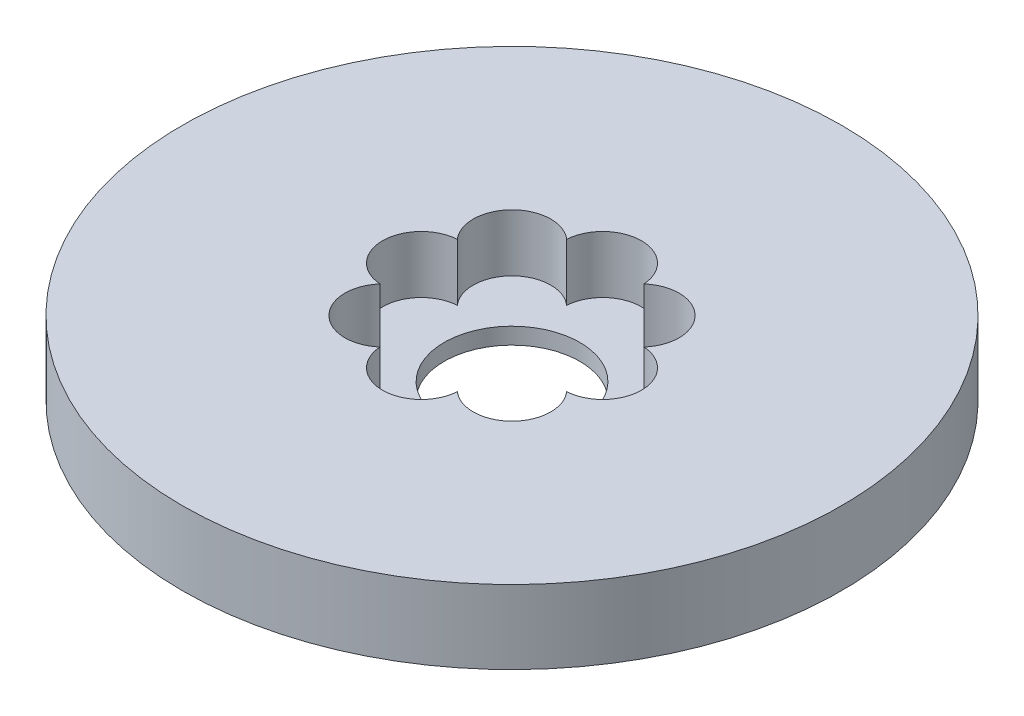
ISO-10303-21;
HEADER;
FILE_DESCRIPTION(('STEP AP214'),'2;1');
FILE_NAME('part.step','',(''),(''),'','','');
FILE_SCHEMA(('AUTOMOTIVE_DESIGN { 1 0 10303 214 1 1 1 1 }'));
ENDSEC;
DATA;
#1=APPLICATION_CONTEXT('core data for automotive mechanical design processes');
#2=APPLICATION_PROTOCOL_DEFINITION('international standard','automotive_design',2000,#1);
#3=PRODUCT_CONTEXT('',#1,'mechanical');
#4=PRODUCT('Part','Part','',(#3));
#5=PRODUCT_RELATED_PRODUCT_CATEGORY('part','',(#4));
#6=PRODUCT_DEFINITION_FORMATION('','',#4);
#7=PRODUCT_DEFINITION_CONTEXT('part definition',#1,'design');
#8=PRODUCT_DEFINITION('design','',#6,#7);
#9=PRODUCT_DEFINITION_SHAPE('','',#8);
#10=(LENGTH_UNIT() NAMED_UNIT(*) SI_UNIT(.MILLI.,.METRE.));
#11=(NAMED_UNIT(*) PLANE_ANGLE_UNIT() SI_UNIT($,.RADIAN.));
#12=(NAMED_UNIT(*) SI_UNIT($,.STERADIAN.) SOLID_ANGLE_UNIT());
#13=UNCERTAINTY_MEASURE_WITH_UNIT(LENGTH_MEASURE(1.E-05),#10,'distance_accuracy_value','');
#14=(GEOMETRIC_REPRESENTATION_CONTEXT(3) GLOBAL_UNCERTAINTY_ASSIGNED_CONTEXT((#13)) GLOBAL_UNIT_ASSIGNED_CONTEXT((#10,
#11,#12)) REPRESENTATION_CONTEXT('',''));
#15=CARTESIAN_POINT('',(0.,0.,0.));
#16=DIRECTION('',(0.,0.,1.));
#17=DIRECTION('',(1.,0.,0.));
#18=AXIS2_PLACEMENT_3D('',#15,#16,#17);
#19=CARTESIAN_POINT('',(0.,19.,0.));
#20=DIRECTION('',(0.,-1.,0.));
#21=DIRECTION('',(0.,0.,-1.));
#22=AXIS2_PLACEMENT_3D('',#19,#20,#21);
#23=CYLINDRICAL_SURFACE('',#22,17.5);
#24=CARTESIAN_POINT('',(0.,0.,0.));
#25=DIRECTION('',(0.,1.,0.));
#26=DIRECTION('',(0.,0.,1.));
#27=AXIS2_PLACEMENT_3D('',#24,#25,#26);
#28=CIRCLE('',#27,17.5);
#29=CARTESIAN_POINT('',(0.,0.,17.5));
#30=VERTEX_POINT('',#29);
#31=EDGE_CURVE('E166',#30,#30,#28,.T.);
#32=ORIENTED_EDGE('',*,*,#31,.F.);
#33=EDGE_LOOP('',(#32));
#34=FACE_BOUND('',#33,.T.);
#35=CARTESIAN_POINT('',(0.,4.2381909272558,0.));
#36=DIRECTION('',(0.,1.,0.));
#37=DIRECTION('',(0.,0.,1.));
#38=AXIS2_PLACEMENT_3D('',#35,#36,#37);
#39=CIRCLE('',#38,17.5);
#40=CARTESIAN_POINT('',(0.,4.2381909272558,17.5));
#41=VERTEX_POINT('',#40);
#42=EDGE_CURVE('E11',#41,#41,#39,.T.);
#43=ORIENTED_EDGE('',*,*,#42,.T.);
#44=EDGE_LOOP('',(#43));
#45=FACE_BOUND('',#44,.T.);
#46=ADVANCED_FACE('F39',(#34,#45),#23,.F.);
#47=CARTESIAN_POINT('',(0.,19.,0.));
#48=DIRECTION('',(0.,-1.,0.));
#49=DIRECTION('',(0.,0.,-1.));
#50=AXIS2_PLACEMENT_3D('',#47,#48,#49);
#51=CYLINDRICAL_SURFACE('',#50,85.);
#52=CARTESIAN_POINT('',(0.,19.,0.));
#53=DIRECTION('',(0.,1.,0.));
#54=DIRECTION('',(0.,0.,1.));
#55=AXIS2_PLACEMENT_3D('',#52,#53,#54);
#56=CIRCLE('',#55,85.);
#57=CARTESIAN_POINT('',(0.,19.,85.));
#58=VERTEX_POINT('',#57);
#59=EDGE_CURVE('E50',#58,#58,#56,.T.);
#60=ORIENTED_EDGE('',*,*,#59,.F.);
#61=EDGE_LOOP('',(#60));
#62=FACE_BOUND('',#61,.T.);
#63=CARTESIAN_POINT('',(0.,0.,0.));
#64=DIRECTION('',(0.,1.,0.));
#65=DIRECTION('',(0.,0.,1.));
#66=AXIS2_PLACEMENT_3D('',#63,#64,#65);
#67=CIRCLE('',#66,85.);
#68=CARTESIAN_POINT('',(0.,0.,85.));
#69=VERTEX_POINT('',#68);
#70=EDGE_CURVE('E173',#69,#69,#67,.T.);
#71=ORIENTED_EDGE('',*,*,#70,.T.);
#72=EDGE_LOOP('',(#71));
#73=FACE_BOUND('',#72,.T.);
#74=ADVANCED_FACE('F41',(#62,#73),#51,.T.);
#75=CARTESIAN_POINT('',(0.,19.,0.));
#76=DIRECTION('',(0.,1.,0.));
#77=DIRECTION('',(0.,0.,1.));
#78=AXIS2_PLACEMENT_3D('',#75,#76,#77);
#79=PLANE('',#78);
#80=CARTESIAN_POINT('',(-16.5430914188715,19.,16.5430914188716));
#81=DIRECTION('',(0.,1.,0.));
#82=DIRECTION('',(0.707106781186549,0.,0.707106781186546));
#83=AXIS2_PLACEMENT_3D('',#80,#81,#82);
#84=CIRCLE('',#83,10.);
#85=CARTESIAN_POINT('',(-24.0847207788115,19.,9.97621799255285));
#86=VERTEX_POINT('',#85);
#87=CARTESIAN_POINT('',(-9.97621799255276,19.,24.0847207788115));
#88=VERTEX_POINT('',#87);
#89=EDGE_CURVE('E159',#86,#88,#84,.T.);
#90=ORIENTED_EDGE('',*,*,#89,.F.);
#91=CARTESIAN_POINT('',(-23.3954642481461,19.,0.));
#92=DIRECTION('',(0.,1.,0.));
#93=DIRECTION('',(0.,0.,1.));
#94=AXIS2_PLACEMENT_3D('',#91,#92,#93);
#95=CIRCLE('',#94,10.);
#96=CARTESIAN_POINT('',(-24.0847207788119,19.,-9.97621799255282));
#97=VERTEX_POINT('',#96);
#98=EDGE_CURVE('E167',#97,#86,#95,.T.);
#99=ORIENTED_EDGE('',*,*,#98,.F.);
#100=CARTESIAN_POINT('',(-16.5430914188718,19.,-16.5430914188714));
#101=DIRECTION('',(0.,1.,0.));
#102=DIRECTION('',(-0.707106781186539,0.,0.707106781186556));
#103=AXIS2_PLACEMENT_3D('',#100,#101,#102);
#104=CIRCLE('',#103,10.);
#105=CARTESIAN_POINT('',(-9.9762179925531,19.,-24.0847207788114));
#106=VERTEX_POINT('',#105);
#107=EDGE_CURVE('E53',#106,#97,#104,.T.);
#108=ORIENTED_EDGE('',*,*,#107,.F.);
#109=CARTESIAN_POINT('',(-2.45054480507922E-13,19.,-23.3954642481461));
#110=DIRECTION('',(0.,1.,0.));
#111=DIRECTION('',(-1.,0.,0.));
#112=AXIS2_PLACEMENT_3D('',#109,#110,#111);
#113=CIRCLE('',#112,10.);
#114=CARTESIAN_POINT('',(9.97621799255259,19.,-24.0847207788116));
#115=VERTEX_POINT('',#114);
#116=EDGE_CURVE('E117',#115,#106,#113,.T.);
#117=ORIENTED_EDGE('',*,*,#116,.F.);
#118=CARTESIAN_POINT('',(16.5430914188714,19.,-16.5430914188717));
#119=DIRECTION('',(0.,1.,0.));
#120=DIRECTION('',(-0.707106781186554,0.,-0.707106781186541));
#121=AXIS2_PLACEMENT_3D('',#118,#119,#120);
#122=CIRCLE('',#121,10.);
#123=CARTESIAN_POINT('',(24.0847207788113,19.,-9.97621799255286));
#124=VERTEX_POINT('',#123);
#125=EDGE_CURVE('E120',#124,#115,#122,.T.);
#126=ORIENTED_EDGE('',*,*,#125,.F.);
#127=CARTESIAN_POINT('',(23.3954642481461,19.,0.));
#128=DIRECTION('',(0.,1.,0.));
#129=DIRECTION('',(0.,0.,-1.));
#130=AXIS2_PLACEMENT_3D('',#127,#128,#129);
#131=CIRCLE('',#130,10.);
#132=CARTESIAN_POINT('',(24.0847207788117,19.,9.97621799255283));
#133=VERTEX_POINT('',#132);
#134=EDGE_CURVE('E136',#133,#124,#131,.T.);
#135=ORIENTED_EDGE('',*,*,#134,.F.);
#136=CARTESIAN_POINT('',(16.5430914188717,19.,16.5430914188715));
#137=DIRECTION('',(0.,1.,0.));
#138=DIRECTION('',(0.707106781186544,0.,-0.707106781186551));
#139=AXIS2_PLACEMENT_3D('',#136,#137,#138);
#140=CIRCLE('',#139,10.);
#141=CARTESIAN_POINT('',(9.97621799255293,19.,24.0847207788115));
#142=VERTEX_POINT('',#141);
#143=EDGE_CURVE('E138',#142,#133,#140,.T.);
#144=ORIENTED_EDGE('',*,*,#143,.F.);
#145=CARTESIAN_POINT('',(0.,19.,23.3954642481461));
#146=DIRECTION('',(0.,1.,0.));
#147=DIRECTION('',(1.,0.,0.));
#148=AXIS2_PLACEMENT_3D('',#145,#146,#147);
#149=CIRCLE('',#148,10.);
#150=EDGE_CURVE('E146',#88,#142,#149,.T.);
#151=ORIENTED_EDGE('',*,*,#150,.F.);
#152=EDGE_LOOP('',(#90,#99,#108,#117,#126,#135,#144,#151));
#153=FACE_BOUND('',#152,.T.);
#154=ORIENTED_EDGE('',*,*,#59,.T.);
#155=EDGE_LOOP('',(#154));
#156=FACE_BOUND('',#155,.T.);
#157=ADVANCED_FACE('F181',(#153,#156),#79,.T.);
#158=CARTESIAN_POINT('',(0.,0.,0.));
#159=DIRECTION('',(0.,1.,0.));
#160=DIRECTION('',(0.,0.,1.));
#161=AXIS2_PLACEMENT_3D('',#158,#159,#160);
#162=PLANE('',#161);
#163=ORIENTED_EDGE('',*,*,#31,.T.);
#164=EDGE_LOOP('',(#163));
#165=FACE_BOUND('',#164,.T.);
#166=ORIENTED_EDGE('',*,*,#70,.F.);
#167=EDGE_LOOP('',(#166));
#168=FACE_BOUND('',#167,.T.);
#169=ADVANCED_FACE('F179',(#165,#168),#162,.F.);
#170=CARTESIAN_POINT('',(-23.3954642481461,4.2381909272558,0.));
#171=DIRECTION('',(0.,1.,0.));
#172=DIRECTION('',(0.,0.,1.));
#173=AXIS2_PLACEMENT_3D('',#170,#171,#172);
#174=CYLINDRICAL_SURFACE('',#173,10.);
#175=ORIENTED_EDGE('',*,*,#98,.T.);
#176=DIRECTION('',(0.,1.,0.));
#177=VECTOR('',#176,1.);
#178=CARTESIAN_POINT('',(-24.0847207788115,11.6190954636279,9.97621799255285));
#179=LINE('',#178,#177);
#180=CARTESIAN_POINT('',(-24.0847207788115,4.2381909272558,9.97621799255285));
#181=VERTEX_POINT('',#180);
#182=EDGE_CURVE('E65',#86,#181,#179,.F.);
#183=ORIENTED_EDGE('',*,*,#182,.T.);
#184=CARTESIAN_POINT('',(-23.3954642481461,4.2381909272558,0.));
#185=DIRECTION('',(0.,1.,0.));
#186=DIRECTION('',(0.,0.,1.));
#187=AXIS2_PLACEMENT_3D('',#184,#185,#186);
#188=CIRCLE('',#187,10.);
#189=CARTESIAN_POINT('',(-24.0847207788119,4.2381909272558,-9.97621799255282));
#190=VERTEX_POINT('',#189);
#191=EDGE_CURVE('E170',#190,#181,#188,.T.);
#192=ORIENTED_EDGE('',*,*,#191,.F.);
#193=DIRECTION('',(0.,1.,0.));
#194=VECTOR('',#193,1.);
#195=CARTESIAN_POINT('',(-24.0847207788119,11.6190954636279,-9.97621799255282));
#196=LINE('',#195,#194);
#197=EDGE_CURVE('E124',#190,#97,#196,.T.);
#198=ORIENTED_EDGE('',*,*,#197,.T.);
#199=EDGE_LOOP('',(#175,#183,#192,#198));
#200=FACE_BOUND('',#199,.T.);
#201=ADVANCED_FACE('F185',(#200),#174,.F.);
#202=CARTESIAN_POINT('',(-23.3954642481461,4.2381909272558,0.));
#203=DIRECTION('',(0.,1.,0.));
#204=DIRECTION('',(0.,0.,1.));
#205=AXIS2_PLACEMENT_3D('',#202,#203,#204);
#206=PLANE('',#205);
#207=ORIENTED_EDGE('',*,*,#191,.T.);
#208=CARTESIAN_POINT('',(-16.5430914188715,4.2381909272558,16.5430914188716));
#209=DIRECTION('',(0.,1.,0.));
#210=DIRECTION('',(0.707106781186549,0.,0.707106781186546));
#211=AXIS2_PLACEMENT_3D('',#208,#209,#210);
#212=CIRCLE('',#211,10.);
#213=CARTESIAN_POINT('',(-9.97621799255276,4.2381909272558,24.0847207788115));
#214=VERTEX_POINT('',#213);
#215=EDGE_CURVE('E161',#181,#214,#212,.T.);
#216=ORIENTED_EDGE('',*,*,#215,.T.);
#217=CARTESIAN_POINT('',(0.,4.2381909272558,23.3954642481461));
#218=DIRECTION('',(0.,1.,0.));
#219=DIRECTION('',(1.,0.,0.));
#220=AXIS2_PLACEMENT_3D('',#217,#218,#219);
#221=CIRCLE('',#220,10.);
#222=CARTESIAN_POINT('',(9.97621799255293,4.2381909272558,24.0847207788115));
#223=VERTEX_POINT('',#222);
#224=EDGE_CURVE('E149',#214,#223,#221,.T.);
#225=ORIENTED_EDGE('',*,*,#224,.T.);
#226=CARTESIAN_POINT('',(16.5430914188717,4.2381909272558,16.5430914188715));
#227=DIRECTION('',(0.,1.,0.));
#228=DIRECTION('',(0.707106781186544,0.,-0.707106781186551));
#229=AXIS2_PLACEMENT_3D('',#226,#227,#228);
#230=CIRCLE('',#229,10.);
#231=CARTESIAN_POINT('',(24.0847207788117,4.2381909272558,9.97621799255283));
#232=VERTEX_POINT('',#231);
#233=EDGE_CURVE('E143',#223,#232,#230,.T.);
#234=ORIENTED_EDGE('',*,*,#233,.T.);
#235=CARTESIAN_POINT('',(23.3954642481461,4.2381909272558,0.));
#236=DIRECTION('',(0.,1.,0.));
#237=DIRECTION('',(0.,0.,-1.));
#238=AXIS2_PLACEMENT_3D('',#235,#236,#237);
#239=CIRCLE('',#238,10.);
#240=CARTESIAN_POINT('',(24.0847207788113,4.2381909272558,-9.97621799255286));
#241=VERTEX_POINT('',#240);
#242=EDGE_CURVE('E140',#232,#241,#239,.T.);
#243=ORIENTED_EDGE('',*,*,#242,.T.);
#244=CARTESIAN_POINT('',(16.5430914188714,4.2381909272558,-16.5430914188717));
#245=DIRECTION('',(0.,1.,0.));
#246=DIRECTION('',(-0.707106781186554,0.,-0.707106781186541));
#247=AXIS2_PLACEMENT_3D('',#244,#245,#246);
#248=CIRCLE('',#247,10.);
#249=CARTESIAN_POINT('',(9.97621799255259,4.2381909272558,-24.0847207788116));
#250=VERTEX_POINT('',#249);
#251=EDGE_CURVE('E111',#241,#250,#248,.T.);
#252=ORIENTED_EDGE('',*,*,#251,.T.);
#253=CARTESIAN_POINT('',(-2.45054480507922E-13,4.2381909272558,-23.3954642481461));
#254=DIRECTION('',(0.,1.,0.));
#255=DIRECTION('',(-1.,0.,0.));
#256=AXIS2_PLACEMENT_3D('',#253,#254,#255);
#257=CIRCLE('',#256,10.);
#258=CARTESIAN_POINT('',(-9.9762179925531,4.2381909272558,-24.0847207788114));
#259=VERTEX_POINT('',#258);
#260=EDGE_CURVE('E104',#250,#259,#257,.T.);
#261=ORIENTED_EDGE('',*,*,#260,.T.);
#262=CARTESIAN_POINT('',(-16.5430914188718,4.2381909272558,-16.5430914188714));
#263=DIRECTION('',(0.,1.,0.));
#264=DIRECTION('',(-0.707106781186539,0.,0.707106781186556));
#265=AXIS2_PLACEMENT_3D('',#262,#263,#264);
#266=CIRCLE('',#265,10.);
#267=EDGE_CURVE('E112',#259,#190,#266,.T.);
#268=ORIENTED_EDGE('',*,*,#267,.T.);
#269=EDGE_LOOP('',(#207,#216,#225,#234,#243,#252,#261,#268));
#270=FACE_BOUND('',#269,.T.);
#271=ORIENTED_EDGE('',*,*,#42,.F.);
#272=EDGE_LOOP('',(#271));
#273=FACE_BOUND('',#272,.T.);
#274=ADVANCED_FACE('F107',(#270,#273),#206,.T.);
#275=CARTESIAN_POINT('',(-16.5430914188715,4.2381909272558,16.5430914188716));
#276=DIRECTION('',(0.,1.,0.));
#277=DIRECTION('',(0.,0.,1.));
#278=AXIS2_PLACEMENT_3D('',#275,#276,#277);
#279=CYLINDRICAL_SURFACE('',#278,10.);
#280=ORIENTED_EDGE('',*,*,#89,.T.);
#281=DIRECTION('',(0.,1.,0.));
#282=VECTOR('',#281,1.);
#283=CARTESIAN_POINT('',(-9.97621799255276,11.6190954636279,24.0847207788115));
#284=LINE('',#283,#282);
#285=EDGE_CURVE('E160',#88,#214,#284,.F.);
#286=ORIENTED_EDGE('',*,*,#285,.T.);
#287=ORIENTED_EDGE('',*,*,#215,.F.);
#288=ORIENTED_EDGE('',*,*,#182,.F.);
#289=EDGE_LOOP('',(#280,#286,#287,#288));
#290=FACE_BOUND('',#289,.T.);
#291=ADVANCED_FACE('F202',(#290),#279,.F.);
#292=CARTESIAN_POINT('',(-16.5430914188718,4.2381909272558,-16.5430914188714));
#293=DIRECTION('',(0.,1.,0.));
#294=DIRECTION('',(0.,0.,1.));
#295=AXIS2_PLACEMENT_3D('',#292,#293,#294);
#296=CYLINDRICAL_SURFACE('',#295,10.);
#297=ORIENTED_EDGE('',*,*,#267,.F.);
#298=DIRECTION('',(0.,1.,0.));
#299=VECTOR('',#298,1.);
#300=CARTESIAN_POINT('',(-9.9762179925531,11.6190954636279,-24.0847207788114));
#301=LINE('',#300,#299);
#302=EDGE_CURVE('E119',#106,#259,#301,.F.);
#303=ORIENTED_EDGE('',*,*,#302,.F.);
#304=ORIENTED_EDGE('',*,*,#107,.T.);
#305=ORIENTED_EDGE('',*,*,#197,.F.);
#306=EDGE_LOOP('',(#297,#303,#304,#305));
#307=FACE_BOUND('',#306,.T.);
#308=ADVANCED_FACE('F123',(#307),#296,.F.);
#309=CARTESIAN_POINT('',(0.,4.2381909272558,23.3954642481461));
#310=DIRECTION('',(0.,1.,0.));
#311=DIRECTION('',(0.,0.,1.));
#312=AXIS2_PLACEMENT_3D('',#309,#310,#311);
#313=CYLINDRICAL_SURFACE('',#312,10.);
#314=ORIENTED_EDGE('',*,*,#150,.T.);
#315=DIRECTION('',(0.,1.,0.));
#316=VECTOR('',#315,1.);
#317=CARTESIAN_POINT('',(9.97621799255293,11.6190954636279,24.0847207788115));
#318=LINE('',#317,#316);
#319=EDGE_CURVE('E141',#142,#223,#318,.F.);
#320=ORIENTED_EDGE('',*,*,#319,.T.);
#321=ORIENTED_EDGE('',*,*,#224,.F.);
#322=ORIENTED_EDGE('',*,*,#285,.F.);
#323=EDGE_LOOP('',(#314,#320,#321,#322));
#324=FACE_BOUND('',#323,.T.);
#325=ADVANCED_FACE('F208',(#324),#313,.F.);
#326=CARTESIAN_POINT('',(16.5430914188717,4.2381909272558,16.5430914188715));
#327=DIRECTION('',(0.,1.,0.));
#328=DIRECTION('',(0.,0.,1.));
#329=AXIS2_PLACEMENT_3D('',#326,#327,#328);
#330=CYLINDRICAL_SURFACE('',#329,10.);
#331=DIRECTION('',(0.,1.,0.));
#332=VECTOR('',#331,1.);
#333=CARTESIAN_POINT('',(24.0847207788117,11.6190954636279,9.97621799255283));
#334=LINE('',#333,#332);
#335=EDGE_CURVE('E151',#133,#232,#334,.F.);
#336=ORIENTED_EDGE('',*,*,#335,.T.);
#337=ORIENTED_EDGE('',*,*,#233,.F.);
#338=ORIENTED_EDGE('',*,*,#319,.F.);
#339=ORIENTED_EDGE('',*,*,#143,.T.);
#340=EDGE_LOOP('',(#336,#337,#338,#339));
#341=FACE_BOUND('',#340,.T.);
#342=ADVANCED_FACE('F211',(#341),#330,.F.);
#343=CARTESIAN_POINT('',(23.3954642481461,4.2381909272558,0.));
#344=DIRECTION('',(0.,1.,0.));
#345=DIRECTION('',(0.,0.,1.));
#346=AXIS2_PLACEMENT_3D('',#343,#344,#345);
#347=CYLINDRICAL_SURFACE('',#346,10.);
#348=ORIENTED_EDGE('',*,*,#134,.T.);
#349=DIRECTION('',(0.,1.,0.));
#350=VECTOR('',#349,1.);
#351=CARTESIAN_POINT('',(24.0847207788113,11.6190954636279,-9.97621799255286));
#352=LINE('',#351,#350);
#353=EDGE_CURVE('E131',#124,#241,#352,.F.);
#354=ORIENTED_EDGE('',*,*,#353,.T.);
#355=ORIENTED_EDGE('',*,*,#242,.F.);
#356=ORIENTED_EDGE('',*,*,#335,.F.);
#357=EDGE_LOOP('',(#348,#354,#355,#356));
#358=FACE_BOUND('',#357,.T.);
#359=ADVANCED_FACE('F214',(#358),#347,.F.);
#360=CARTESIAN_POINT('',(16.5430914188714,4.2381909272558,-16.5430914188717));
#361=DIRECTION('',(0.,1.,0.));
#362=DIRECTION('',(0.,0.,1.));
#363=AXIS2_PLACEMENT_3D('',#360,#361,#362);
#364=CYLINDRICAL_SURFACE('',#363,10.);
#365=DIRECTION('',(0.,1.,0.));
#366=VECTOR('',#365,1.);
#367=CARTESIAN_POINT('',(9.97621799255259,11.6190954636279,-24.0847207788116));
#368=LINE('',#367,#366);
#369=EDGE_CURVE('E154',#115,#250,#368,.F.);
#370=ORIENTED_EDGE('',*,*,#369,.T.);
#371=ORIENTED_EDGE('',*,*,#251,.F.);
#372=ORIENTED_EDGE('',*,*,#353,.F.);
#373=ORIENTED_EDGE('',*,*,#125,.T.);
#374=EDGE_LOOP('',(#370,#371,#372,#373));
#375=FACE_BOUND('',#374,.T.);
#376=ADVANCED_FACE('F218',(#375),#364,.F.);
#377=CARTESIAN_POINT('',(-2.45054480507922E-13,4.2381909272558,-23.3954642481461));
#378=DIRECTION('',(0.,1.,0.));
#379=DIRECTION('',(0.,0.,1.));
#380=AXIS2_PLACEMENT_3D('',#377,#378,#379);
#381=CYLINDRICAL_SURFACE('',#380,10.);
#382=ORIENTED_EDGE('',*,*,#116,.T.);
#383=ORIENTED_EDGE('',*,*,#302,.T.);
#384=ORIENTED_EDGE('',*,*,#260,.F.);
#385=ORIENTED_EDGE('',*,*,#369,.F.);
#386=EDGE_LOOP('',(#382,#383,#384,#385));
#387=FACE_BOUND('',#386,.T.);
#388=ADVANCED_FACE('F121',(#387),#381,.F.);
#389=CLOSED_SHELL('',(#46,#74,#157,#169,#201,#274,#291,#308,#325,#342,#359,#376,#388));
#390=MANIFOLD_SOLID_BREP('B2',#389);
#391=ADVANCED_BREP_SHAPE_REPRESENTATION('',(#18,#390),#14);
#392=SHAPE_DEFINITION_REPRESENTATION(#9,#391);
ENDSEC;
END-ISO-10303-21;
